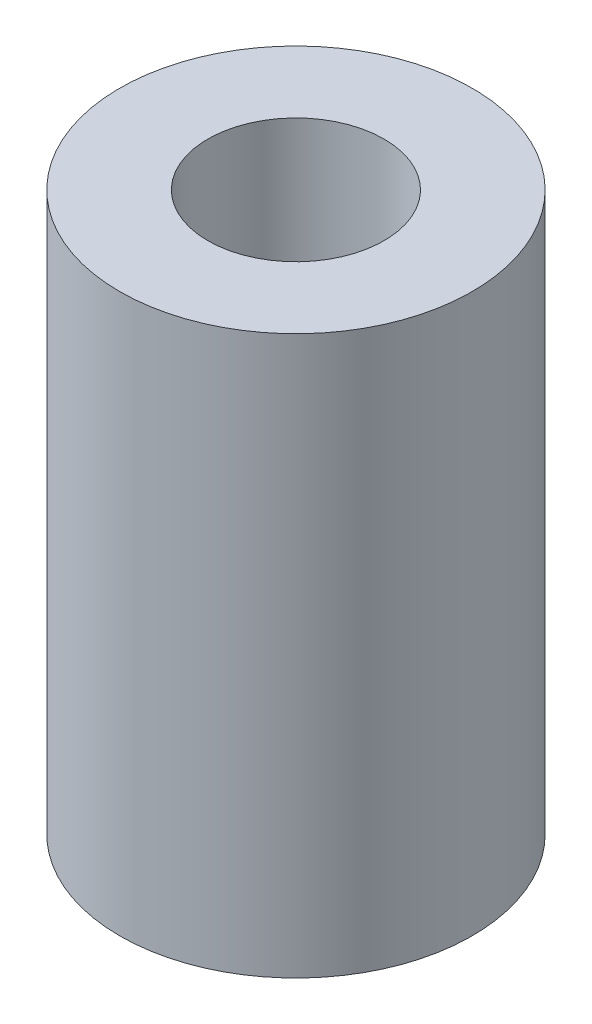
ISO-10303-21;
HEADER;
FILE_DESCRIPTION(('STEP AP214'),'2;1');
FILE_NAME('part.step','',(''),(''),'','','');
FILE_SCHEMA(('AUTOMOTIVE_DESIGN { 1 0 10303 214 1 1 1 1 }'));
ENDSEC;
DATA;
#1=APPLICATION_CONTEXT('core data for automotive mechanical design processes');
#2=APPLICATION_PROTOCOL_DEFINITION('international standard','automotive_design',2000,#1);
#3=PRODUCT_CONTEXT('',#1,'mechanical');
#4=PRODUCT('Part','Part','',(#3));
#5=PRODUCT_RELATED_PRODUCT_CATEGORY('part','',(#4));
#6=PRODUCT_DEFINITION_FORMATION('','',#4);
#7=PRODUCT_DEFINITION_CONTEXT('part definition',#1,'design');
#8=PRODUCT_DEFINITION('design','',#6,#7);
#9=PRODUCT_DEFINITION_SHAPE('','',#8);
#10=(LENGTH_UNIT() NAMED_UNIT(*) SI_UNIT(.MILLI.,.METRE.));
#11=(NAMED_UNIT(*) PLANE_ANGLE_UNIT() SI_UNIT($,.RADIAN.));
#12=(NAMED_UNIT(*) SI_UNIT($,.STERADIAN.) SOLID_ANGLE_UNIT());
#13=UNCERTAINTY_MEASURE_WITH_UNIT(LENGTH_MEASURE(1.E-05),#10,'distance_accuracy_value','');
#14=(GEOMETRIC_REPRESENTATION_CONTEXT(3) GLOBAL_UNCERTAINTY_ASSIGNED_CONTEXT((#13)) GLOBAL_UNIT_ASSIGNED_CONTEXT((#10,
#11,#12)) REPRESENTATION_CONTEXT('',''));
#15=CARTESIAN_POINT('',(0.,0.,0.));
#16=DIRECTION('',(0.,0.,1.));
#17=DIRECTION('',(1.,0.,0.));
#18=AXIS2_PLACEMENT_3D('',#15,#16,#17);
#19=CARTESIAN_POINT('',(0.,19.,0.));
#20=DIRECTION('',(0.,1.,0.));
#21=DIRECTION('',(0.,0.,1.));
#22=AXIS2_PLACEMENT_3D('',#19,#20,#21);
#23=PLANE('',#22);
#24=CARTESIAN_POINT('',(0.,19.,0.));
#25=DIRECTION('',(0.,1.,0.));
#26=DIRECTION('',(0.,0.,1.));
#27=AXIS2_PLACEMENT_3D('',#24,#25,#26);
#28=CIRCLE('',#27,6.);
#29=CARTESIAN_POINT('',(0.,19.,6.));
#30=VERTEX_POINT('',#29);
#31=EDGE_CURVE('E10',#30,#30,#28,.T.);
#32=ORIENTED_EDGE('',*,*,#31,.T.);
#33=EDGE_LOOP('',(#32));
#34=FACE_BOUND('',#33,.T.);
#35=CARTESIAN_POINT('',(0.,19.,0.));
#36=DIRECTION('',(0.,1.,0.));
#37=DIRECTION('',(0.,0.,1.));
#38=AXIS2_PLACEMENT_3D('',#35,#36,#37);
#39=CIRCLE('',#38,3.);
#40=CARTESIAN_POINT('',(0.,19.,3.));
#41=VERTEX_POINT('',#40);
#42=EDGE_CURVE('E48',#41,#41,#39,.T.);
#43=ORIENTED_EDGE('',*,*,#42,.F.);
#44=EDGE_LOOP('',(#43));
#45=FACE_BOUND('',#44,.T.);
#46=ADVANCED_FACE('F37',(#34,#45),#23,.T.);
#47=CARTESIAN_POINT('',(0.,0.,0.));
#48=DIRECTION('',(0.,1.,0.));
#49=DIRECTION('',(0.,0.,1.));
#50=AXIS2_PLACEMENT_3D('',#47,#48,#49);
#51=PLANE('',#50);
#52=CARTESIAN_POINT('',(0.,0.,0.));
#53=DIRECTION('',(0.,1.,0.));
#54=DIRECTION('',(0.,0.,1.));
#55=AXIS2_PLACEMENT_3D('',#52,#53,#54);
#56=CIRCLE('',#55,6.);
#57=CARTESIAN_POINT('',(0.,0.,6.));
#58=VERTEX_POINT('',#57);
#59=EDGE_CURVE('E41',#58,#58,#56,.T.);
#60=ORIENTED_EDGE('',*,*,#59,.F.);
#61=EDGE_LOOP('',(#60));
#62=FACE_BOUND('',#61,.T.);
#63=CARTESIAN_POINT('',(0.,0.,0.));
#64=DIRECTION('',(0.,1.,0.));
#65=DIRECTION('',(0.,0.,1.));
#66=AXIS2_PLACEMENT_3D('',#63,#64,#65);
#67=CIRCLE('',#66,3.);
#68=CARTESIAN_POINT('',(0.,0.,3.));
#69=VERTEX_POINT('',#68);
#70=EDGE_CURVE('E50',#69,#69,#67,.T.);
#71=ORIENTED_EDGE('',*,*,#70,.T.);
#72=EDGE_LOOP('',(#71));
#73=FACE_BOUND('',#72,.T.);
#74=ADVANCED_FACE('F60',(#62,#73),#51,.F.);
#75=CARTESIAN_POINT('',(0.,19.,0.));
#76=DIRECTION('',(0.,-1.,0.));
#77=DIRECTION('',(0.,0.,-1.));
#78=AXIS2_PLACEMENT_3D('',#75,#76,#77);
#79=CYLINDRICAL_SURFACE('',#78,6.);
#80=ORIENTED_EDGE('',*,*,#31,.F.);
#81=EDGE_LOOP('',(#80));
#82=FACE_BOUND('',#81,.T.);
#83=ORIENTED_EDGE('',*,*,#59,.T.);
#84=EDGE_LOOP('',(#83));
#85=FACE_BOUND('',#84,.T.);
#86=ADVANCED_FACE('F39',(#82,#85),#79,.T.);
#87=CARTESIAN_POINT('',(0.,19.,0.));
#88=DIRECTION('',(0.,-1.,0.));
#89=DIRECTION('',(0.,0.,-1.));
#90=AXIS2_PLACEMENT_3D('',#87,#88,#89);
#91=CYLINDRICAL_SURFACE('',#90,3.);
#92=ORIENTED_EDGE('',*,*,#42,.T.);
#93=EDGE_LOOP('',(#92));
#94=FACE_BOUND('',#93,.T.);
#95=ORIENTED_EDGE('',*,*,#70,.F.);
#96=EDGE_LOOP('',(#95));
#97=FACE_BOUND('',#96,.T.);
#98=ADVANCED_FACE('F56',(#94,#97),#91,.F.);
#99=CLOSED_SHELL('',(#46,#74,#86,#98));
#100=MANIFOLD_SOLID_BREP('B2',#99);
#101=ADVANCED_BREP_SHAPE_REPRESENTATION('',(#18,#100),#14);
#102=SHAPE_DEFINITION_REPRESENTATION(#9,#101);
ENDSEC;
END-ISO-10303-21;
